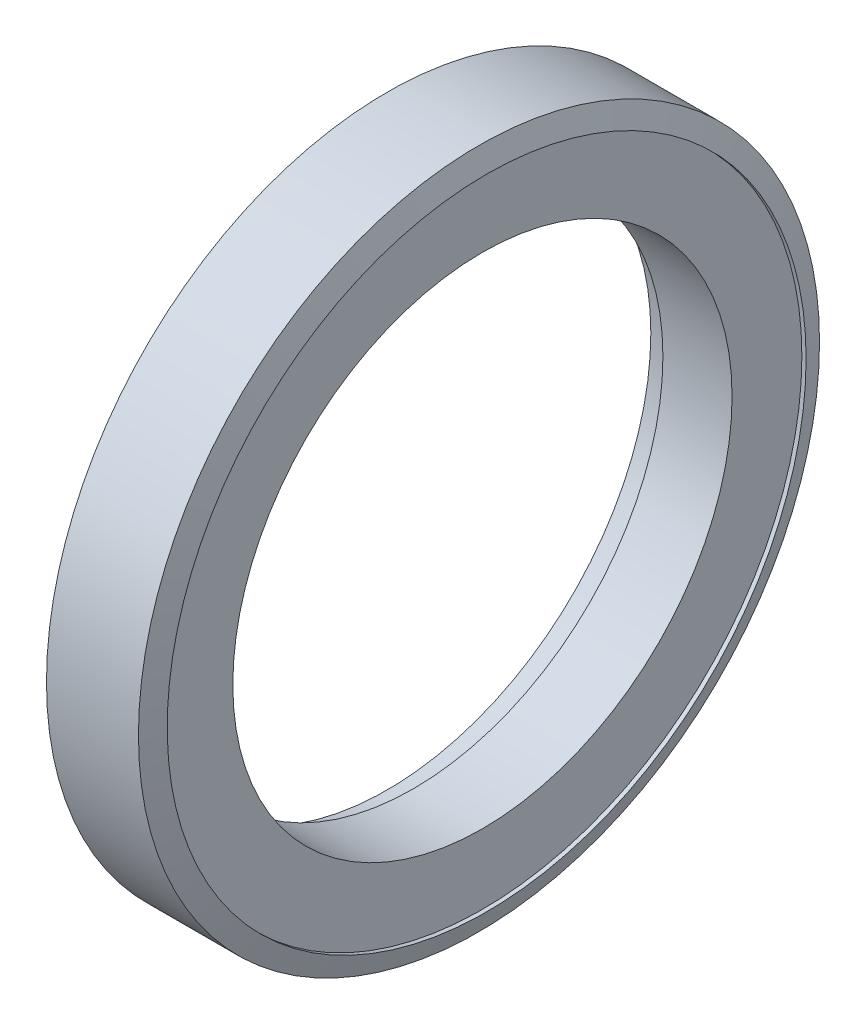
ISO-10303-21;
HEADER;
FILE_DESCRIPTION(('STEP AP214'),'2;1');
FILE_NAME('part.step','',(''),(''),'','','');
FILE_SCHEMA(('AUTOMOTIVE_DESIGN { 1 0 10303 214 1 1 1 1 }'));
ENDSEC;
DATA;
#1=APPLICATION_CONTEXT('core data for automotive mechanical design processes');
#2=APPLICATION_PROTOCOL_DEFINITION('international standard','automotive_design',2000,#1);
#3=PRODUCT_CONTEXT('',#1,'mechanical');
#4=PRODUCT('Part','Part','',(#3));
#5=PRODUCT_RELATED_PRODUCT_CATEGORY('part','',(#4));
#6=PRODUCT_DEFINITION_FORMATION('','',#4);
#7=PRODUCT_DEFINITION_CONTEXT('part definition',#1,'design');
#8=PRODUCT_DEFINITION('design','',#6,#7);
#9=PRODUCT_DEFINITION_SHAPE('','',#8);
#10=(LENGTH_UNIT() NAMED_UNIT(*) SI_UNIT(.MILLI.,.METRE.));
#11=(NAMED_UNIT(*) PLANE_ANGLE_UNIT() SI_UNIT($,.RADIAN.));
#12=(NAMED_UNIT(*) SI_UNIT($,.STERADIAN.) SOLID_ANGLE_UNIT());
#13=UNCERTAINTY_MEASURE_WITH_UNIT(LENGTH_MEASURE(1.E-05),#10,'distance_accuracy_value','');
#14=(GEOMETRIC_REPRESENTATION_CONTEXT(3) GLOBAL_UNCERTAINTY_ASSIGNED_CONTEXT((#13)) GLOBAL_UNIT_ASSIGNED_CONTEXT((#10,
#11,#12)) REPRESENTATION_CONTEXT('',''));
#15=CARTESIAN_POINT('',(0.,0.,0.));
#16=DIRECTION('',(0.,0.,1.));
#17=DIRECTION('',(1.,0.,0.));
#18=AXIS2_PLACEMENT_3D('',#15,#16,#17);
#19=CARTESIAN_POINT('',(7.3524999999999,0.,0.));
#20=DIRECTION('',(1.,0.,0.));
#21=DIRECTION('',(0.,0.,-1.));
#22=AXIS2_PLACEMENT_3D('',#19,#20,#21);
#23=CYLINDRICAL_SURFACE('',#22,30.1625);
#24=CARTESIAN_POINT('',(11.5299999999998,0.,0.));
#25=DIRECTION('',(1.,0.,0.));
#26=DIRECTION('',(0.,0.,-1.));
#27=AXIS2_PLACEMENT_3D('',#24,#25,#26);
#28=CIRCLE('',#27,30.1625);
#29=CARTESIAN_POINT('',(11.5299999999998,0.,-30.1625));
#30=VERTEX_POINT('',#29);
#31=EDGE_CURVE('E18',#30,#30,#28,.F.);
#32=ORIENTED_EDGE('',*,*,#31,.F.);
#33=EDGE_LOOP('',(#32));
#34=FACE_BOUND('',#33,.T.);
#35=CARTESIAN_POINT('',(3.17500000000005,0.,0.));
#36=DIRECTION('',(1.,0.,0.));
#37=DIRECTION('',(0.,0.,-1.));
#38=AXIS2_PLACEMENT_3D('',#35,#36,#37);
#39=CIRCLE('',#38,30.1625);
#40=CARTESIAN_POINT('',(3.17500000000005,0.,-30.1625));
#41=VERTEX_POINT('',#40);
#42=EDGE_CURVE('E41',#41,#41,#39,.T.);
#43=ORIENTED_EDGE('',*,*,#42,.F.);
#44=EDGE_LOOP('',(#43));
#45=FACE_BOUND('',#44,.T.);
#46=ADVANCED_FACE('F15',(#34,#45),#23,.F.);
#47=CARTESIAN_POINT('',(11.5299999999997,34.3812499999992,0.));
#48=DIRECTION('',(1.,0.,0.));
#49=DIRECTION('',(0.,0.,-1.));
#50=AXIS2_PLACEMENT_3D('',#47,#48,#49);
#51=PLANE('',#50);
#52=ORIENTED_EDGE('',*,*,#31,.T.);
#53=EDGE_LOOP('',(#52));
#54=FACE_BOUND('',#53,.T.);
#55=CARTESIAN_POINT('',(11.5299999999997,0.,0.));
#56=DIRECTION('',(1.,0.,0.));
#57=DIRECTION('',(0.,0.,-1.));
#58=AXIS2_PLACEMENT_3D('',#55,#56,#57);
#59=CIRCLE('',#58,38.5999999999985);
#60=CARTESIAN_POINT('',(11.5299999999997,0.,-38.5999999999985));
#61=VERTEX_POINT('',#60);
#62=EDGE_CURVE('E39',#61,#61,#59,.T.);
#63=ORIENTED_EDGE('',*,*,#62,.T.);
#64=EDGE_LOOP('',(#63));
#65=FACE_BOUND('',#64,.T.);
#66=ADVANCED_FACE('F48',(#54,#65),#51,.T.);
#67=CARTESIAN_POINT('',(3.17500000000005,31.01975,0.));
#68=DIRECTION('',(-1.,0.,0.));
#69=DIRECTION('',(0.,0.,1.));
#70=AXIS2_PLACEMENT_3D('',#67,#68,#69);
#71=PLANE('',#70);
#72=ORIENTED_EDGE('',*,*,#42,.T.);
#73=EDGE_LOOP('',(#72));
#74=FACE_BOUND('',#73,.T.);
#75=CARTESIAN_POINT('',(3.17500000000005,0.,0.));
#76=DIRECTION('',(1.,0.,0.));
#77=DIRECTION('',(0.,0.,-1.));
#78=AXIS2_PLACEMENT_3D('',#75,#76,#77);
#79=CIRCLE('',#78,31.877);
#80=CARTESIAN_POINT('',(3.17500000000005,0.,-31.877));
#81=VERTEX_POINT('',#80);
#82=EDGE_CURVE('E36',#81,#81,#79,.F.);
#83=ORIENTED_EDGE('',*,*,#82,.T.);
#84=EDGE_LOOP('',(#83));
#85=FACE_BOUND('',#84,.T.);
#86=ADVANCED_FACE('F57',(#74,#85),#71,.T.);
#87=CARTESIAN_POINT('',(11.7849999999998,0.,0.));
#88=DIRECTION('',(1.,0.,0.));
#89=DIRECTION('',(0.,0.,-1.));
#90=AXIS2_PLACEMENT_3D('',#87,#88,#89);
#91=CYLINDRICAL_SURFACE('',#90,38.5999999999985);
#92=CARTESIAN_POINT('',(12.0400000017785,0.,0.));
#93=DIRECTION('',(-1.,0.,0.));
#94=DIRECTION('',(0.,1.,0.));
#95=AXIS2_PLACEMENT_3D('',#92,#93,#94);
#96=CIRCLE('',#95,38.6000000006458);
#97=CARTESIAN_POINT('',(12.0400000017785,38.6000000006458,0.));
#98=VERTEX_POINT('',#97);
#99=EDGE_CURVE('E35',#98,#98,#96,.T.);
#100=ORIENTED_EDGE('',*,*,#99,.F.);
#101=EDGE_LOOP('',(#100));
#102=FACE_BOUND('',#101,.T.);
#103=ORIENTED_EDGE('',*,*,#62,.F.);
#104=EDGE_LOOP('',(#103));
#105=FACE_BOUND('',#104,.T.);
#106=ADVANCED_FACE('F76',(#102,#105),#91,.F.);
#107=CARTESIAN_POINT('',(1.58750000000003,0.,0.));
#108=DIRECTION('',(1.,0.,0.));
#109=DIRECTION('',(0.,0.,-1.));
#110=AXIS2_PLACEMENT_3D('',#107,#108,#109);
#111=CYLINDRICAL_SURFACE('',#110,31.877);
#112=ORIENTED_EDGE('',*,*,#82,.F.);
#113=EDGE_LOOP('',(#112));
#114=FACE_BOUND('',#113,.T.);
#115=CARTESIAN_POINT('',(0.,0.,0.));
#116=DIRECTION('',(1.,0.,0.));
#117=DIRECTION('',(0.,0.,-1.));
#118=AXIS2_PLACEMENT_3D('',#115,#116,#117);
#119=CIRCLE('',#118,31.877);
#120=CARTESIAN_POINT('',(0.,0.,-31.877));
#121=VERTEX_POINT('',#120);
#122=EDGE_CURVE('E27',#121,#121,#119,.T.);
#123=ORIENTED_EDGE('',*,*,#122,.F.);
#124=EDGE_LOOP('',(#123));
#125=FACE_BOUND('',#124,.T.);
#126=ADVANCED_FACE('F72',(#114,#125),#111,.F.);
#127=CARTESIAN_POINT('',(11.1126038413105,0.,0.));
#128=DIRECTION('',(-1.,0.,0.));
#129=DIRECTION('',(0.,0.,1.));
#130=AXIS2_PLACEMENT_3D('',#127,#128,#129);
#131=CONICAL_SURFACE('',#130,41.1479999993527,1.221730475);
#132=CARTESIAN_POINT('',(11.1126038430891,0.,0.));
#133=DIRECTION('',(1.,0.,0.));
#134=DIRECTION('',(0.,0.,-1.));
#135=AXIS2_PLACEMENT_3D('',#132,#133,#134);
#136=CIRCLE('',#135,41.148);
#137=CARTESIAN_POINT('',(11.1126038430891,0.,-41.148));
#138=VERTEX_POINT('',#137);
#139=EDGE_CURVE('E22',#138,#138,#136,.F.);
#140=ORIENTED_EDGE('',*,*,#139,.F.);
#141=EDGE_LOOP('',(#140));
#142=FACE_BOUND('',#141,.T.);
#143=ORIENTED_EDGE('',*,*,#99,.T.);
#144=EDGE_LOOP('',(#143));
#145=FACE_BOUND('',#144,.T.);
#146=ADVANCED_FACE('F65',(#142,#145),#131,.T.);
#147=CARTESIAN_POINT('',(0.,36.5125,0.));
#148=DIRECTION('',(-1.,0.,0.));
#149=DIRECTION('',(0.,0.,1.));
#150=AXIS2_PLACEMENT_3D('',#147,#148,#149);
#151=PLANE('',#150);
#152=ORIENTED_EDGE('',*,*,#122,.T.);
#153=EDGE_LOOP('',(#152));
#154=FACE_BOUND('',#153,.T.);
#155=CARTESIAN_POINT('',(0.,0.,0.));
#156=DIRECTION('',(1.,0.,0.));
#157=DIRECTION('',(0.,0.,-1.));
#158=AXIS2_PLACEMENT_3D('',#155,#156,#157);
#159=CIRCLE('',#158,41.148);
#160=CARTESIAN_POINT('',(0.,0.,-41.148));
#161=VERTEX_POINT('',#160);
#162=EDGE_CURVE('E10',#161,#161,#159,.T.);
#163=ORIENTED_EDGE('',*,*,#162,.F.);
#164=EDGE_LOOP('',(#163));
#165=FACE_BOUND('',#164,.T.);
#166=ADVANCED_FACE('F60',(#154,#165),#151,.T.);
#167=CARTESIAN_POINT('',(5.55630192154452,0.,0.));
#168=DIRECTION('',(1.,0.,0.));
#169=DIRECTION('',(0.,0.,-1.));
#170=AXIS2_PLACEMENT_3D('',#167,#168,#169);
#171=CYLINDRICAL_SURFACE('',#170,41.148);
#172=ORIENTED_EDGE('',*,*,#162,.T.);
#173=EDGE_LOOP('',(#172));
#174=FACE_BOUND('',#173,.T.);
#175=ORIENTED_EDGE('',*,*,#139,.T.);
#176=EDGE_LOOP('',(#175));
#177=FACE_BOUND('',#176,.T.);
#178=ADVANCED_FACE('F58',(#174,#177),#171,.T.);
#179=CLOSED_SHELL('',(#46,#66,#86,#106,#126,#146,#166,#178));
#180=MANIFOLD_SOLID_BREP('B1',#179);
#181=ADVANCED_BREP_SHAPE_REPRESENTATION('',(#18,#180),#14);
#182=SHAPE_DEFINITION_REPRESENTATION(#9,#181);
ENDSEC;
END-ISO-10303-21;
